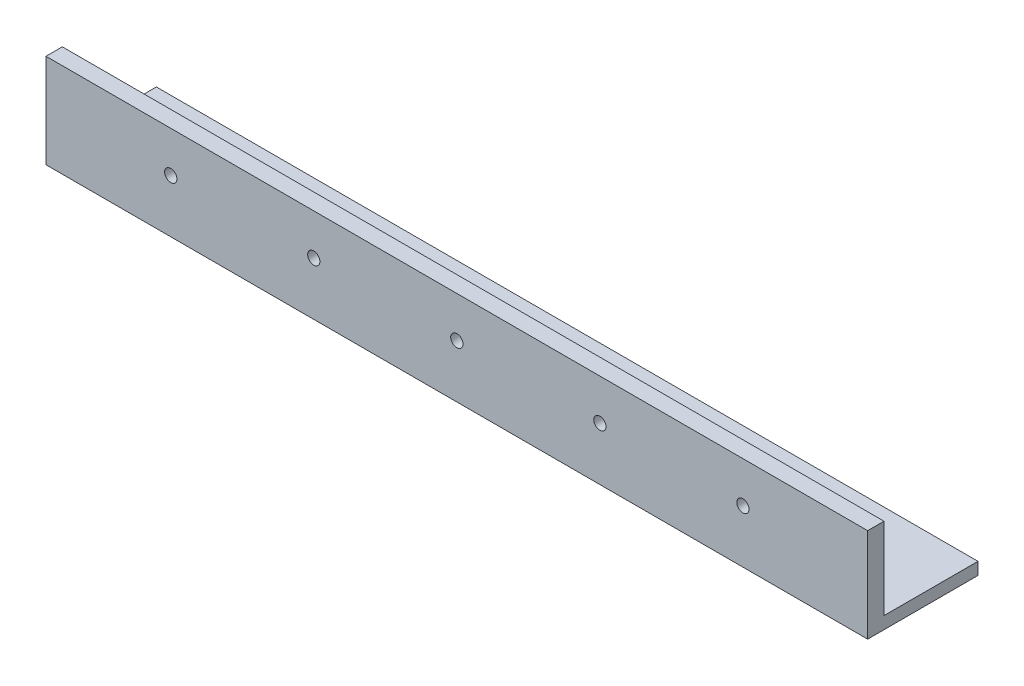
ISO-10303-21;
HEADER;
FILE_DESCRIPTION(('STEP AP214'),'2;1');
FILE_NAME('part.step','',(''),(''),'','','');
FILE_SCHEMA(('AUTOMOTIVE_DESIGN { 1 0 10303 214 1 1 1 1 }'));
ENDSEC;
DATA;
#1=APPLICATION_CONTEXT('core data for automotive mechanical design processes');
#2=APPLICATION_PROTOCOL_DEFINITION('international standard','automotive_design',2000,#1);
#3=PRODUCT_CONTEXT('',#1,'mechanical');
#4=PRODUCT('Part','Part','',(#3));
#5=PRODUCT_RELATED_PRODUCT_CATEGORY('part','',(#4));
#6=PRODUCT_DEFINITION_FORMATION('','',#4);
#7=PRODUCT_DEFINITION_CONTEXT('part definition',#1,'design');
#8=PRODUCT_DEFINITION('design','',#6,#7);
#9=PRODUCT_DEFINITION_SHAPE('','',#8);
#10=(LENGTH_UNIT() NAMED_UNIT(*) SI_UNIT(.MILLI.,.METRE.));
#11=(NAMED_UNIT(*) PLANE_ANGLE_UNIT() SI_UNIT($,.RADIAN.));
#12=(NAMED_UNIT(*) SI_UNIT($,.STERADIAN.) SOLID_ANGLE_UNIT());
#13=UNCERTAINTY_MEASURE_WITH_UNIT(LENGTH_MEASURE(1.E-05),#10,'distance_accuracy_value','');
#14=(GEOMETRIC_REPRESENTATION_CONTEXT(3) GLOBAL_UNCERTAINTY_ASSIGNED_CONTEXT((#13)) GLOBAL_UNIT_ASSIGNED_CONTEXT((#10,
#11,#12)) REPRESENTATION_CONTEXT('',''));
#15=CARTESIAN_POINT('',(0.,0.,0.));
#16=DIRECTION('',(0.,0.,1.));
#17=DIRECTION('',(1.,0.,0.));
#18=AXIS2_PLACEMENT_3D('',#15,#16,#17);
#19=CARTESIAN_POINT('',(171.40864649794,106.320231303639,160.37742762242));
#20=DIRECTION('',(-1.,0.,0.));
#21=DIRECTION('',(0.,0.,1.));
#22=AXIS2_PLACEMENT_3D('',#19,#20,#21);
#23=PLANE('',#22);
#24=DIRECTION('',(0.,-1.,0.));
#25=VECTOR('',#24,1.);
#26=CARTESIAN_POINT('',(171.40864649794,106.320231303639,164.37742762242));
#27=LINE('',#26,#25);
#28=CARTESIAN_POINT('',(171.40864649794,106.320231303639,164.37742762242));
#29=VERTEX_POINT('',#28);
#30=CARTESIAN_POINT('',(171.40864649794,83.3202313036392,164.37742762242));
#31=VERTEX_POINT('',#30);
#32=EDGE_CURVE('E108',#29,#31,#27,.T.);
#33=ORIENTED_EDGE('',*,*,#32,.T.);
#34=DIRECTION('',(0.,0.,-1.));
#35=VECTOR('',#34,1.);
#36=CARTESIAN_POINT('',(171.40864649794,83.3202313036392,137.37742762242));
#37=LINE('',#36,#35);
#38=CARTESIAN_POINT('',(171.40864649794,83.3202313036392,137.37742762242));
#39=VERTEX_POINT('',#38);
#40=EDGE_CURVE('E102',#31,#39,#37,.T.);
#41=ORIENTED_EDGE('',*,*,#40,.T.);
#42=DIRECTION('',(0.,1.,0.));
#43=VECTOR('',#42,1.);
#44=CARTESIAN_POINT('',(171.40864649794,83.3202313036392,137.37742762242));
#45=LINE('',#44,#43);
#46=CARTESIAN_POINT('',(171.40864649794,86.3202313036392,137.37742762242));
#47=VERTEX_POINT('',#46);
#48=EDGE_CURVE('E85',#39,#47,#45,.T.);
#49=ORIENTED_EDGE('',*,*,#48,.T.);
#50=DIRECTION('',(0.,0.,-1.));
#51=VECTOR('',#50,1.);
#52=CARTESIAN_POINT('',(171.40864649794,86.3202313036392,137.37742762242));
#53=LINE('',#52,#51);
#54=CARTESIAN_POINT('',(171.40864649794,86.3202313036392,160.37742762242));
#55=VERTEX_POINT('',#54);
#56=EDGE_CURVE('E116',#55,#47,#53,.T.);
#57=ORIENTED_EDGE('',*,*,#56,.F.);
#58=DIRECTION('',(0.,-1.,0.));
#59=VECTOR('',#58,1.);
#60=CARTESIAN_POINT('',(171.40864649794,106.320231303639,160.37742762242));
#61=LINE('',#60,#59);
#62=CARTESIAN_POINT('',(171.40864649794,106.320231303639,160.37742762242));
#63=VERTEX_POINT('',#62);
#64=EDGE_CURVE('E11',#63,#55,#61,.T.);
#65=ORIENTED_EDGE('',*,*,#64,.F.);
#66=DIRECTION('',(0.,0.,-1.));
#67=VECTOR('',#66,1.);
#68=CARTESIAN_POINT('',(171.40864649794,106.320231303639,160.37742762242));
#69=LINE('',#68,#67);
#70=EDGE_CURVE('E136',#29,#63,#69,.T.);
#71=ORIENTED_EDGE('',*,*,#70,.F.);
#72=EDGE_LOOP('',(#33,#41,#49,#57,#65,#71));
#73=FACE_BOUND('',#72,.T.);
#74=ADVANCED_FACE('F34',(#73),#23,.F.);
#75=CARTESIAN_POINT('',(-29.6513535020601,106.320231303639,160.37742762242));
#76=DIRECTION('',(0.,0.,1.));
#77=DIRECTION('',(1.,0.,0.));
#78=AXIS2_PLACEMENT_3D('',#75,#76,#77);
#79=PLANE('',#78);
#80=CARTESIAN_POINT('',(0.878646497939978,96.3202313036392,160.37742762242));
#81=DIRECTION('',(0.,0.,1.));
#82=DIRECTION('',(1.,0.,0.));
#83=AXIS2_PLACEMENT_3D('',#80,#81,#82);
#84=CIRCLE('',#83,1.5);
#85=CARTESIAN_POINT('',(2.37864649793998,96.3202313036392,160.37742762242));
#86=VERTEX_POINT('',#85);
#87=EDGE_CURVE('E121',#86,#86,#84,.T.);
#88=ORIENTED_EDGE('',*,*,#87,.T.);
#89=EDGE_LOOP('',(#88));
#90=FACE_BOUND('',#89,.T.);
#91=CARTESIAN_POINT('',(35.87864649794,96.3202313036392,160.37742762242));
#92=DIRECTION('',(0.,0.,1.));
#93=DIRECTION('',(1.,0.,0.));
#94=AXIS2_PLACEMENT_3D('',#91,#92,#93);
#95=CIRCLE('',#94,1.5);
#96=CARTESIAN_POINT('',(37.37864649794,96.3202313036392,160.37742762242));
#97=VERTEX_POINT('',#96);
#98=EDGE_CURVE('E125',#97,#97,#95,.T.);
#99=ORIENTED_EDGE('',*,*,#98,.T.);
#100=EDGE_LOOP('',(#99));
#101=FACE_BOUND('',#100,.T.);
#102=CARTESIAN_POINT('',(70.87864649794,96.3202313036392,160.37742762242));
#103=DIRECTION('',(0.,0.,1.));
#104=DIRECTION('',(1.,0.,0.));
#105=AXIS2_PLACEMENT_3D('',#102,#103,#104);
#106=CIRCLE('',#105,1.5);
#107=CARTESIAN_POINT('',(72.37864649794,96.3202313036392,160.37742762242));
#108=VERTEX_POINT('',#107);
#109=EDGE_CURVE('E128',#108,#108,#106,.T.);
#110=ORIENTED_EDGE('',*,*,#109,.T.);
#111=EDGE_LOOP('',(#110));
#112=FACE_BOUND('',#111,.T.);
#113=CARTESIAN_POINT('',(105.87864649794,96.3202313036392,160.37742762242));
#114=DIRECTION('',(0.,0.,1.));
#115=DIRECTION('',(1.,0.,0.));
#116=AXIS2_PLACEMENT_3D('',#113,#114,#115);
#117=CIRCLE('',#116,1.5);
#118=CARTESIAN_POINT('',(107.37864649794,96.3202313036392,160.37742762242));
#119=VERTEX_POINT('',#118);
#120=EDGE_CURVE('E131',#119,#119,#117,.T.);
#121=ORIENTED_EDGE('',*,*,#120,.T.);
#122=EDGE_LOOP('',(#121));
#123=FACE_BOUND('',#122,.T.);
#124=CARTESIAN_POINT('',(140.87864649794,96.3202313036392,160.37742762242));
#125=DIRECTION('',(0.,0.,1.));
#126=DIRECTION('',(1.,0.,0.));
#127=AXIS2_PLACEMENT_3D('',#124,#125,#126);
#128=CIRCLE('',#127,1.5);
#129=CARTESIAN_POINT('',(142.37864649794,96.3202313036392,160.37742762242));
#130=VERTEX_POINT('',#129);
#131=EDGE_CURVE('E119',#130,#130,#128,.T.);
#132=ORIENTED_EDGE('',*,*,#131,.T.);
#133=EDGE_LOOP('',(#132));
#134=FACE_BOUND('',#133,.T.);
#135=DIRECTION('',(-1.,0.,0.));
#136=VECTOR('',#135,1.);
#137=CARTESIAN_POINT('',(-29.6513535020601,86.3202313036392,160.37742762242));
#138=LINE('',#137,#136);
#139=CARTESIAN_POINT('',(-29.6513535020601,86.3202313036392,160.37742762242));
#140=VERTEX_POINT('',#139);
#141=EDGE_CURVE('E139',#55,#140,#138,.T.);
#142=ORIENTED_EDGE('',*,*,#141,.T.);
#143=DIRECTION('',(0.,-1.,0.));
#144=VECTOR('',#143,1.);
#145=CARTESIAN_POINT('',(-29.6513535020601,106.320231303639,160.37742762242));
#146=LINE('',#145,#144);
#147=CARTESIAN_POINT('',(-29.6513535020601,106.320231303639,160.37742762242));
#148=VERTEX_POINT('',#147);
#149=EDGE_CURVE('E43',#148,#140,#146,.T.);
#150=ORIENTED_EDGE('',*,*,#149,.F.);
#151=DIRECTION('',(-1.,0.,0.));
#152=VECTOR('',#151,1.);
#153=CARTESIAN_POINT('',(-29.6513535020601,106.320231303639,160.37742762242));
#154=LINE('',#153,#152);
#155=EDGE_CURVE('E138',#63,#148,#154,.T.);
#156=ORIENTED_EDGE('',*,*,#155,.F.);
#157=ORIENTED_EDGE('',*,*,#64,.T.);
#158=EDGE_LOOP('',(#142,#150,#156,#157));
#159=FACE_BOUND('',#158,.T.);
#160=ADVANCED_FACE('F185',(#90,#101,#112,#123,#134,#159),#79,.F.);
#161=CARTESIAN_POINT('',(-29.6513535020601,106.320231303639,160.37742762242));
#162=DIRECTION('',(1.,0.,0.));
#163=DIRECTION('',(0.,0.,-1.));
#164=AXIS2_PLACEMENT_3D('',#161,#162,#163);
#165=PLANE('',#164);
#166=ORIENTED_EDGE('',*,*,#149,.T.);
#167=DIRECTION('',(0.,0.,1.));
#168=VECTOR('',#167,1.);
#169=CARTESIAN_POINT('',(-29.6513535020601,86.3202313036392,137.37742762242));
#170=LINE('',#169,#168);
#171=CARTESIAN_POINT('',(-29.6513535020601,86.3202313036392,137.37742762242));
#172=VERTEX_POINT('',#171);
#173=EDGE_CURVE('E109',#172,#140,#170,.T.);
#174=ORIENTED_EDGE('',*,*,#173,.F.);
#175=DIRECTION('',(0.,1.,0.));
#176=VECTOR('',#175,1.);
#177=CARTESIAN_POINT('',(-29.6513535020601,83.3202313036392,137.37742762242));
#178=LINE('',#177,#176);
#179=CARTESIAN_POINT('',(-29.6513535020601,83.3202313036392,137.37742762242));
#180=VERTEX_POINT('',#179);
#181=EDGE_CURVE('E94',#180,#172,#178,.T.);
#182=ORIENTED_EDGE('',*,*,#181,.F.);
#183=DIRECTION('',(0.,0.,1.));
#184=VECTOR('',#183,1.);
#185=CARTESIAN_POINT('',(-29.6513535020601,83.3202313036392,137.37742762242));
#186=LINE('',#185,#184);
#187=CARTESIAN_POINT('',(-29.6513535020601,83.3202313036392,164.37742762242));
#188=VERTEX_POINT('',#187);
#189=EDGE_CURVE('E105',#180,#188,#186,.T.);
#190=ORIENTED_EDGE('',*,*,#189,.T.);
#191=DIRECTION('',(0.,-1.,0.));
#192=VECTOR('',#191,1.);
#193=CARTESIAN_POINT('',(-29.6513535020601,106.320231303639,164.37742762242));
#194=LINE('',#193,#192);
#195=CARTESIAN_POINT('',(-29.6513535020601,106.320231303639,164.37742762242));
#196=VERTEX_POINT('',#195);
#197=EDGE_CURVE('E147',#196,#188,#194,.T.);
#198=ORIENTED_EDGE('',*,*,#197,.F.);
#199=DIRECTION('',(0.,0.,1.));
#200=VECTOR('',#199,1.);
#201=CARTESIAN_POINT('',(-29.6513535020601,106.320231303639,160.37742762242));
#202=LINE('',#201,#200);
#203=EDGE_CURVE('E141',#148,#196,#202,.T.);
#204=ORIENTED_EDGE('',*,*,#203,.F.);
#205=EDGE_LOOP('',(#166,#174,#182,#190,#198,#204));
#206=FACE_BOUND('',#205,.T.);
#207=ADVANCED_FACE('F189',(#206),#165,.F.);
#208=CARTESIAN_POINT('',(-29.6513535020601,106.320231303639,164.37742762242));
#209=DIRECTION('',(0.,0.,-1.));
#210=DIRECTION('',(-1.,0.,0.));
#211=AXIS2_PLACEMENT_3D('',#208,#209,#210);
#212=PLANE('',#211);
#213=CARTESIAN_POINT('',(0.878646497939978,96.3202313036392,164.37742762242));
#214=DIRECTION('',(0.,0.,-1.));
#215=DIRECTION('',(-1.,0.,0.));
#216=AXIS2_PLACEMENT_3D('',#213,#214,#215);
#217=CIRCLE('',#216,1.5);
#218=CARTESIAN_POINT('',(-0.62135350206002,96.3202313036392,164.37742762242));
#219=VERTEX_POINT('',#218);
#220=EDGE_CURVE('E37',#219,#219,#217,.T.);
#221=ORIENTED_EDGE('',*,*,#220,.T.);
#222=EDGE_LOOP('',(#221));
#223=FACE_BOUND('',#222,.T.);
#224=CARTESIAN_POINT('',(35.87864649794,96.3202313036392,164.37742762242));
#225=DIRECTION('',(0.,0.,-1.));
#226=DIRECTION('',(-1.,0.,0.));
#227=AXIS2_PLACEMENT_3D('',#224,#225,#226);
#228=CIRCLE('',#227,1.5);
#229=CARTESIAN_POINT('',(34.37864649794,96.3202313036392,164.37742762242));
#230=VERTEX_POINT('',#229);
#231=EDGE_CURVE('E158',#230,#230,#228,.T.);
#232=ORIENTED_EDGE('',*,*,#231,.T.);
#233=EDGE_LOOP('',(#232));
#234=FACE_BOUND('',#233,.T.);
#235=CARTESIAN_POINT('',(70.87864649794,96.3202313036392,164.37742762242));
#236=DIRECTION('',(0.,0.,-1.));
#237=DIRECTION('',(-1.,0.,0.));
#238=AXIS2_PLACEMENT_3D('',#235,#236,#237);
#239=CIRCLE('',#238,1.5);
#240=CARTESIAN_POINT('',(69.37864649794,96.3202313036392,164.37742762242));
#241=VERTEX_POINT('',#240);
#242=EDGE_CURVE('E156',#241,#241,#239,.T.);
#243=ORIENTED_EDGE('',*,*,#242,.T.);
#244=EDGE_LOOP('',(#243));
#245=FACE_BOUND('',#244,.T.);
#246=CARTESIAN_POINT('',(105.87864649794,96.3202313036392,164.37742762242));
#247=DIRECTION('',(0.,0.,-1.));
#248=DIRECTION('',(-1.,0.,0.));
#249=AXIS2_PLACEMENT_3D('',#246,#247,#248);
#250=CIRCLE('',#249,1.5);
#251=CARTESIAN_POINT('',(104.37864649794,96.3202313036392,164.37742762242));
#252=VERTEX_POINT('',#251);
#253=EDGE_CURVE('E153',#252,#252,#250,.T.);
#254=ORIENTED_EDGE('',*,*,#253,.T.);
#255=EDGE_LOOP('',(#254));
#256=FACE_BOUND('',#255,.T.);
#257=CARTESIAN_POINT('',(140.87864649794,96.3202313036392,164.37742762242));
#258=DIRECTION('',(0.,0.,-1.));
#259=DIRECTION('',(-1.,0.,0.));
#260=AXIS2_PLACEMENT_3D('',#257,#258,#259);
#261=CIRCLE('',#260,1.5);
#262=CARTESIAN_POINT('',(139.37864649794,96.3202313036392,164.37742762242));
#263=VERTEX_POINT('',#262);
#264=EDGE_CURVE('E124',#263,#263,#261,.T.);
#265=ORIENTED_EDGE('',*,*,#264,.T.);
#266=EDGE_LOOP('',(#265));
#267=FACE_BOUND('',#266,.T.);
#268=ORIENTED_EDGE('',*,*,#197,.T.);
#269=DIRECTION('',(1.,0.,0.));
#270=VECTOR('',#269,1.);
#271=CARTESIAN_POINT('',(-29.6513535020601,83.3202313036392,164.37742762242));
#272=LINE('',#271,#270);
#273=EDGE_CURVE('E95',#188,#31,#272,.T.);
#274=ORIENTED_EDGE('',*,*,#273,.T.);
#275=ORIENTED_EDGE('',*,*,#32,.F.);
#276=DIRECTION('',(1.,0.,0.));
#277=VECTOR('',#276,1.);
#278=CARTESIAN_POINT('',(-29.6513535020601,106.320231303639,164.37742762242));
#279=LINE('',#278,#277);
#280=EDGE_CURVE('E51',#196,#29,#279,.T.);
#281=ORIENTED_EDGE('',*,*,#280,.F.);
#282=EDGE_LOOP('',(#268,#274,#275,#281));
#283=FACE_BOUND('',#282,.T.);
#284=ADVANCED_FACE('F165',(#223,#234,#245,#256,#267,#283),#212,.F.);
#285=CARTESIAN_POINT('',(70.8786464979399,106.320231303639,162.37742762242));
#286=DIRECTION('',(0.,1.,0.));
#287=DIRECTION('',(0.,0.,1.));
#288=AXIS2_PLACEMENT_3D('',#285,#286,#287);
#289=PLANE('',#288);
#290=ORIENTED_EDGE('',*,*,#70,.T.);
#291=ORIENTED_EDGE('',*,*,#155,.T.);
#292=ORIENTED_EDGE('',*,*,#203,.T.);
#293=ORIENTED_EDGE('',*,*,#280,.T.);
#294=EDGE_LOOP('',(#290,#291,#292,#293));
#295=FACE_BOUND('',#294,.T.);
#296=ADVANCED_FACE('F200',(#295),#289,.T.);
#297=CARTESIAN_POINT('',(140.87864649794,96.3202313036392,160.37742762242));
#298=DIRECTION('',(0.,0.,1.));
#299=DIRECTION('',(1.,0.,0.));
#300=AXIS2_PLACEMENT_3D('',#297,#298,#299);
#301=CYLINDRICAL_SURFACE('',#300,1.5);
#302=ORIENTED_EDGE('',*,*,#131,.F.);
#303=EDGE_LOOP('',(#302));
#304=FACE_BOUND('',#303,.T.);
#305=ORIENTED_EDGE('',*,*,#264,.F.);
#306=EDGE_LOOP('',(#305));
#307=FACE_BOUND('',#306,.T.);
#308=ADVANCED_FACE('F203',(#304,#307),#301,.F.);
#309=CARTESIAN_POINT('',(105.87864649794,96.3202313036392,160.37742762242));
#310=DIRECTION('',(0.,0.,1.));
#311=DIRECTION('',(1.,0.,0.));
#312=AXIS2_PLACEMENT_3D('',#309,#310,#311);
#313=CYLINDRICAL_SURFACE('',#312,1.5);
#314=ORIENTED_EDGE('',*,*,#120,.F.);
#315=EDGE_LOOP('',(#314));
#316=FACE_BOUND('',#315,.T.);
#317=ORIENTED_EDGE('',*,*,#253,.F.);
#318=EDGE_LOOP('',(#317));
#319=FACE_BOUND('',#318,.T.);
#320=ADVANCED_FACE('F206',(#316,#319),#313,.F.);
#321=CARTESIAN_POINT('',(70.87864649794,96.3202313036392,160.37742762242));
#322=DIRECTION('',(0.,0.,1.));
#323=DIRECTION('',(1.,0.,0.));
#324=AXIS2_PLACEMENT_3D('',#321,#322,#323);
#325=CYLINDRICAL_SURFACE('',#324,1.5);
#326=ORIENTED_EDGE('',*,*,#109,.F.);
#327=EDGE_LOOP('',(#326));
#328=FACE_BOUND('',#327,.T.);
#329=ORIENTED_EDGE('',*,*,#242,.F.);
#330=EDGE_LOOP('',(#329));
#331=FACE_BOUND('',#330,.T.);
#332=ADVANCED_FACE('F179',(#328,#331),#325,.F.);
#333=CARTESIAN_POINT('',(35.87864649794,96.3202313036392,160.37742762242));
#334=DIRECTION('',(0.,0.,1.));
#335=DIRECTION('',(1.,0.,0.));
#336=AXIS2_PLACEMENT_3D('',#333,#334,#335);
#337=CYLINDRICAL_SURFACE('',#336,1.5);
#338=ORIENTED_EDGE('',*,*,#98,.F.);
#339=EDGE_LOOP('',(#338));
#340=FACE_BOUND('',#339,.T.);
#341=ORIENTED_EDGE('',*,*,#231,.F.);
#342=EDGE_LOOP('',(#341));
#343=FACE_BOUND('',#342,.T.);
#344=ADVANCED_FACE('F170',(#340,#343),#337,.F.);
#345=CARTESIAN_POINT('',(0.878646497939978,96.3202313036392,160.37742762242));
#346=DIRECTION('',(0.,0.,1.));
#347=DIRECTION('',(1.,0.,0.));
#348=AXIS2_PLACEMENT_3D('',#345,#346,#347);
#349=CYLINDRICAL_SURFACE('',#348,1.5);
#350=ORIENTED_EDGE('',*,*,#87,.F.);
#351=EDGE_LOOP('',(#350));
#352=FACE_BOUND('',#351,.T.);
#353=ORIENTED_EDGE('',*,*,#220,.F.);
#354=EDGE_LOOP('',(#353));
#355=FACE_BOUND('',#354,.T.);
#356=ADVANCED_FACE('F167',(#352,#355),#349,.F.);
#357=CARTESIAN_POINT('',(70.8786464979399,86.3202313036392,150.87742762242));
#358=DIRECTION('',(0.,1.,0.));
#359=DIRECTION('',(0.,0.,1.));
#360=AXIS2_PLACEMENT_3D('',#357,#358,#359);
#361=PLANE('',#360);
#362=ORIENTED_EDGE('',*,*,#141,.F.);
#363=ORIENTED_EDGE('',*,*,#56,.T.);
#364=DIRECTION('',(-1.,0.,0.));
#365=VECTOR('',#364,1.);
#366=CARTESIAN_POINT('',(-29.6513535020601,86.3202313036392,137.37742762242));
#367=LINE('',#366,#365);
#368=EDGE_CURVE('E90',#47,#172,#367,.T.);
#369=ORIENTED_EDGE('',*,*,#368,.T.);
#370=ORIENTED_EDGE('',*,*,#173,.T.);
#371=EDGE_LOOP('',(#362,#363,#369,#370));
#372=FACE_BOUND('',#371,.T.);
#373=ADVANCED_FACE('F169',(#372),#361,.T.);
#374=CARTESIAN_POINT('',(-29.6513535020601,83.3202313036392,137.37742762242));
#375=DIRECTION('',(0.,0.,-1.));
#376=DIRECTION('',(-1.,0.,0.));
#377=AXIS2_PLACEMENT_3D('',#374,#375,#376);
#378=PLANE('',#377);
#379=ORIENTED_EDGE('',*,*,#368,.F.);
#380=ORIENTED_EDGE('',*,*,#48,.F.);
#381=DIRECTION('',(-1.,0.,0.));
#382=VECTOR('',#381,1.);
#383=CARTESIAN_POINT('',(-29.6513535020601,83.3202313036392,137.37742762242));
#384=LINE('',#383,#382);
#385=EDGE_CURVE('E88',#39,#180,#384,.T.);
#386=ORIENTED_EDGE('',*,*,#385,.T.);
#387=ORIENTED_EDGE('',*,*,#181,.T.);
#388=EDGE_LOOP('',(#379,#380,#386,#387));
#389=FACE_BOUND('',#388,.T.);
#390=ADVANCED_FACE('F87',(#389),#378,.T.);
#391=CARTESIAN_POINT('',(70.8786464979399,83.3202313036392,150.87742762242));
#392=DIRECTION('',(0.,1.,0.));
#393=DIRECTION('',(0.,0.,1.));
#394=AXIS2_PLACEMENT_3D('',#391,#392,#393);
#395=PLANE('',#394);
#396=ORIENTED_EDGE('',*,*,#40,.F.);
#397=ORIENTED_EDGE('',*,*,#273,.F.);
#398=ORIENTED_EDGE('',*,*,#189,.F.);
#399=ORIENTED_EDGE('',*,*,#385,.F.);
#400=EDGE_LOOP('',(#396,#397,#398,#399));
#401=FACE_BOUND('',#400,.T.);
#402=ADVANCED_FACE('F100',(#401),#395,.F.);
#403=CLOSED_SHELL('',(#74,#160,#207,#284,#296,#308,#320,#332,#344,#356,#373,#390,#402));
#404=MANIFOLD_SOLID_BREP('B2',#403);
#405=ADVANCED_BREP_SHAPE_REPRESENTATION('',(#18,#404),#14);
#406=SHAPE_DEFINITION_REPRESENTATION(#9,#405);
ENDSEC;
END-ISO-10303-21;
